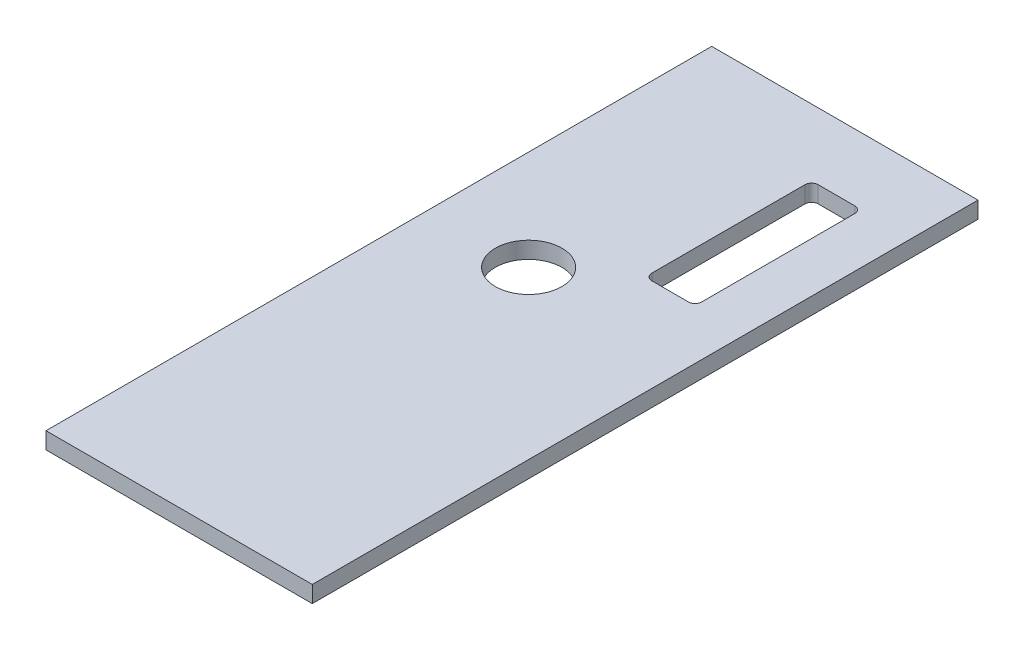
ISO-10303-21;
HEADER;
FILE_DESCRIPTION(('STEP AP214'),'2;1');
FILE_NAME('part.step','',(''),(''),'','','');
FILE_SCHEMA(('AUTOMOTIVE_DESIGN { 1 0 10303 214 1 1 1 1 }'));
ENDSEC;
DATA;
#1=APPLICATION_CONTEXT('core data for automotive mechanical design processes');
#2=APPLICATION_PROTOCOL_DEFINITION('international standard','automotive_design',2000,#1);
#3=PRODUCT_CONTEXT('',#1,'mechanical');
#4=PRODUCT('Part','Part','',(#3));
#5=PRODUCT_RELATED_PRODUCT_CATEGORY('part','',(#4));
#6=PRODUCT_DEFINITION_FORMATION('','',#4);
#7=PRODUCT_DEFINITION_CONTEXT('part definition',#1,'design');
#8=PRODUCT_DEFINITION('design','',#6,#7);
#9=PRODUCT_DEFINITION_SHAPE('','',#8);
#10=(LENGTH_UNIT() NAMED_UNIT(*) SI_UNIT(.MILLI.,.METRE.));
#11=(NAMED_UNIT(*) PLANE_ANGLE_UNIT() SI_UNIT($,.RADIAN.));
#12=(NAMED_UNIT(*) SI_UNIT($,.STERADIAN.) SOLID_ANGLE_UNIT());
#13=UNCERTAINTY_MEASURE_WITH_UNIT(LENGTH_MEASURE(1.E-05),#10,'distance_accuracy_value','');
#14=(GEOMETRIC_REPRESENTATION_CONTEXT(3) GLOBAL_UNCERTAINTY_ASSIGNED_CONTEXT((#13)) GLOBAL_UNIT_ASSIGNED_CONTEXT((#10,
#11,#12)) REPRESENTATION_CONTEXT('',''));
#15=CARTESIAN_POINT('',(0.,0.,0.));
#16=DIRECTION('',(0.,0.,1.));
#17=DIRECTION('',(1.,0.,0.));
#18=AXIS2_PLACEMENT_3D('',#15,#16,#17);
#19=CARTESIAN_POINT('',(0.,6.35,0.));
#20=DIRECTION('',(0.,1.,0.));
#21=DIRECTION('',(0.,0.,1.));
#22=AXIS2_PLACEMENT_3D('',#19,#20,#21);
#23=PLANE('',#22);
#24=DIRECTION('',(0.,0.,1.));
#25=VECTOR('',#24,1.);
#26=CARTESIAN_POINT('',(-50.8,6.35,127.));
#27=LINE('',#26,#25);
#28=CARTESIAN_POINT('',(-50.8,6.35,-127.));
#29=VERTEX_POINT('',#28);
#30=CARTESIAN_POINT('',(-50.8,6.35,127.));
#31=VERTEX_POINT('',#30);
#32=EDGE_CURVE('E193',#29,#31,#27,.T.);
#33=ORIENTED_EDGE('',*,*,#32,.T.);
#34=DIRECTION('',(1.,0.,0.));
#35=VECTOR('',#34,1.);
#36=CARTESIAN_POINT('',(50.8,6.35,127.));
#37=LINE('',#36,#35);
#38=CARTESIAN_POINT('',(50.8,6.35,127.));
#39=VERTEX_POINT('',#38);
#40=EDGE_CURVE('E196',#31,#39,#37,.T.);
#41=ORIENTED_EDGE('',*,*,#40,.T.);
#42=DIRECTION('',(0.,0.,-1.));
#43=VECTOR('',#42,1.);
#44=CARTESIAN_POINT('',(50.8,6.35,127.));
#45=LINE('',#44,#43);
#46=CARTESIAN_POINT('',(50.8,6.35,-127.));
#47=VERTEX_POINT('',#46);
#48=EDGE_CURVE('E199',#39,#47,#45,.T.);
#49=ORIENTED_EDGE('',*,*,#48,.T.);
#50=DIRECTION('',(-1.,0.,0.));
#51=VECTOR('',#50,1.);
#52=CARTESIAN_POINT('',(50.8,6.35,-127.));
#53=LINE('',#52,#51);
#54=EDGE_CURVE('E201',#47,#29,#53,.T.);
#55=ORIENTED_EDGE('',*,*,#54,.T.);
#56=EDGE_LOOP('',(#33,#41,#49,#55));
#57=FACE_BOUND('',#56,.T.);
#58=CARTESIAN_POINT('',(-12.7,6.35,-19.05));
#59=DIRECTION('',(0.,1.,0.));
#60=DIRECTION('',(0.,0.,1.));
#61=AXIS2_PLACEMENT_3D('',#58,#59,#60);
#62=CIRCLE('',#61,12.7);
#63=CARTESIAN_POINT('',(-12.7,6.35,-6.34999999999996));
#64=VERTEX_POINT('',#63);
#65=EDGE_CURVE('E187',#64,#64,#62,.T.);
#66=ORIENTED_EDGE('',*,*,#65,.F.);
#67=EDGE_LOOP('',(#66));
#68=FACE_BOUND('',#67,.T.);
#69=DIRECTION('',(1.,0.,0.));
#70=VECTOR('',#69,1.);
#71=CARTESIAN_POINT('',(29.21,6.35,-38.1));
#72=LINE('',#71,#70);
#73=CARTESIAN_POINT('',(15.24,6.35,-38.1));
#74=VERTEX_POINT('',#73);
#75=CARTESIAN_POINT('',(29.21,6.35,-38.1));
#76=VERTEX_POINT('',#75);
#77=EDGE_CURVE('E130',#74,#76,#72,.T.);
#78=ORIENTED_EDGE('',*,*,#77,.F.);
#79=CARTESIAN_POINT('',(15.24,6.35,-40.64));
#80=DIRECTION('',(0.,1.,0.));
#81=DIRECTION('',(0.,0.,-1.));
#82=AXIS2_PLACEMENT_3D('',#79,#80,#81);
#83=CIRCLE('',#82,2.54);
#84=CARTESIAN_POINT('',(12.7,6.35,-40.64));
#85=VERTEX_POINT('',#84);
#86=EDGE_CURVE('E122',#85,#74,#83,.T.);
#87=ORIENTED_EDGE('',*,*,#86,.F.);
#88=DIRECTION('',(0.,0.,1.));
#89=VECTOR('',#88,1.);
#90=CARTESIAN_POINT('',(12.7,6.35,-99.06));
#91=LINE('',#90,#89);
#92=CARTESIAN_POINT('',(12.7,6.35,-99.06));
#93=VERTEX_POINT('',#92);
#94=EDGE_CURVE('E155',#93,#85,#91,.T.);
#95=ORIENTED_EDGE('',*,*,#94,.F.);
#96=CARTESIAN_POINT('',(15.24,6.35,-99.06));
#97=DIRECTION('',(0.,1.,0.));
#98=DIRECTION('',(0.,0.,1.));
#99=AXIS2_PLACEMENT_3D('',#96,#97,#98);
#100=CIRCLE('',#99,2.54);
#101=CARTESIAN_POINT('',(15.24,6.35,-101.6));
#102=VERTEX_POINT('',#101);
#103=EDGE_CURVE('E153',#102,#93,#100,.T.);
#104=ORIENTED_EDGE('',*,*,#103,.F.);
#105=DIRECTION('',(-1.,0.,0.));
#106=VECTOR('',#105,1.);
#107=CARTESIAN_POINT('',(29.21,6.35,-101.6));
#108=LINE('',#107,#106);
#109=CARTESIAN_POINT('',(29.21,6.35,-101.6));
#110=VERTEX_POINT('',#109);
#111=EDGE_CURVE('E151',#110,#102,#108,.T.);
#112=ORIENTED_EDGE('',*,*,#111,.F.);
#113=CARTESIAN_POINT('',(29.21,6.35,-99.06));
#114=DIRECTION('',(0.,1.,0.));
#115=DIRECTION('',(0.,0.,-1.));
#116=AXIS2_PLACEMENT_3D('',#113,#114,#115);
#117=CIRCLE('',#116,2.54);
#118=CARTESIAN_POINT('',(31.75,6.35,-99.06));
#119=VERTEX_POINT('',#118);
#120=EDGE_CURVE('E149',#119,#110,#117,.T.);
#121=ORIENTED_EDGE('',*,*,#120,.F.);
#122=DIRECTION('',(0.,0.,-1.));
#123=VECTOR('',#122,1.);
#124=CARTESIAN_POINT('',(31.75,6.35,-99.06));
#125=LINE('',#124,#123);
#126=CARTESIAN_POINT('',(31.75,6.35,-40.64));
#127=VERTEX_POINT('',#126);
#128=EDGE_CURVE('E145',#127,#119,#125,.T.);
#129=ORIENTED_EDGE('',*,*,#128,.F.);
#130=CARTESIAN_POINT('',(29.21,6.35,-40.64));
#131=DIRECTION('',(0.,1.,0.));
#132=DIRECTION('',(0.,0.,-1.));
#133=AXIS2_PLACEMENT_3D('',#130,#131,#132);
#134=CIRCLE('',#133,2.54);
#135=EDGE_CURVE('E143',#76,#127,#134,.T.);
#136=ORIENTED_EDGE('',*,*,#135,.F.);
#137=EDGE_LOOP('',(#78,#87,#95,#104,#112,#121,#129,#136));
#138=FACE_BOUND('',#137,.T.);
#139=ADVANCED_FACE('F33',(#57,#68,#138),#23,.T.);
#140=CARTESIAN_POINT('',(0.,0.,0.));
#141=DIRECTION('',(0.,1.,0.));
#142=DIRECTION('',(0.,0.,1.));
#143=AXIS2_PLACEMENT_3D('',#140,#141,#142);
#144=PLANE('',#143);
#145=CARTESIAN_POINT('',(-12.7,0.,-19.05));
#146=DIRECTION('',(0.,1.,0.));
#147=DIRECTION('',(0.,0.,1.));
#148=AXIS2_PLACEMENT_3D('',#145,#146,#147);
#149=CIRCLE('',#148,12.7);
#150=CARTESIAN_POINT('',(-12.7,0.,-6.34999999999996));
#151=VERTEX_POINT('',#150);
#152=EDGE_CURVE('E138',#151,#151,#149,.T.);
#153=ORIENTED_EDGE('',*,*,#152,.T.);
#154=EDGE_LOOP('',(#153));
#155=FACE_BOUND('',#154,.T.);
#156=DIRECTION('',(0.,0.,1.));
#157=VECTOR('',#156,1.);
#158=CARTESIAN_POINT('',(-50.8,0.,127.));
#159=LINE('',#158,#157);
#160=CARTESIAN_POINT('',(-50.8,0.,-127.));
#161=VERTEX_POINT('',#160);
#162=CARTESIAN_POINT('',(-50.8,0.,127.));
#163=VERTEX_POINT('',#162);
#164=EDGE_CURVE('E190',#161,#163,#159,.T.);
#165=ORIENTED_EDGE('',*,*,#164,.F.);
#166=DIRECTION('',(-1.,0.,0.));
#167=VECTOR('',#166,1.);
#168=CARTESIAN_POINT('',(50.8,0.,-127.));
#169=LINE('',#168,#167);
#170=CARTESIAN_POINT('',(50.8,0.,-127.));
#171=VERTEX_POINT('',#170);
#172=EDGE_CURVE('E197',#171,#161,#169,.T.);
#173=ORIENTED_EDGE('',*,*,#172,.F.);
#174=DIRECTION('',(0.,0.,-1.));
#175=VECTOR('',#174,1.);
#176=CARTESIAN_POINT('',(50.8,0.,127.));
#177=LINE('',#176,#175);
#178=CARTESIAN_POINT('',(50.8,0.,127.));
#179=VERTEX_POINT('',#178);
#180=EDGE_CURVE('E208',#179,#171,#177,.T.);
#181=ORIENTED_EDGE('',*,*,#180,.F.);
#182=DIRECTION('',(1.,0.,0.));
#183=VECTOR('',#182,1.);
#184=CARTESIAN_POINT('',(50.8,0.,127.));
#185=LINE('',#184,#183);
#186=EDGE_CURVE('E206',#163,#179,#185,.T.);
#187=ORIENTED_EDGE('',*,*,#186,.F.);
#188=EDGE_LOOP('',(#165,#173,#181,#187));
#189=FACE_BOUND('',#188,.T.);
#190=CARTESIAN_POINT('',(15.24,0.,-40.64));
#191=DIRECTION('',(0.,1.,0.));
#192=DIRECTION('',(0.,0.,-1.));
#193=AXIS2_PLACEMENT_3D('',#190,#191,#192);
#194=CIRCLE('',#193,2.54);
#195=CARTESIAN_POINT('',(12.7,0.,-40.64));
#196=VERTEX_POINT('',#195);
#197=CARTESIAN_POINT('',(15.24,0.,-38.1));
#198=VERTEX_POINT('',#197);
#199=EDGE_CURVE('E56',#196,#198,#194,.T.);
#200=ORIENTED_EDGE('',*,*,#199,.T.);
#201=DIRECTION('',(1.,0.,0.));
#202=VECTOR('',#201,1.);
#203=CARTESIAN_POINT('',(29.21,0.,-38.1));
#204=LINE('',#203,#202);
#205=CARTESIAN_POINT('',(29.21,0.,-38.1));
#206=VERTEX_POINT('',#205);
#207=EDGE_CURVE('E137',#198,#206,#204,.T.);
#208=ORIENTED_EDGE('',*,*,#207,.T.);
#209=CARTESIAN_POINT('',(29.21,0.,-40.64));
#210=DIRECTION('',(0.,1.,0.));
#211=DIRECTION('',(0.,0.,-1.));
#212=AXIS2_PLACEMENT_3D('',#209,#210,#211);
#213=CIRCLE('',#212,2.54);
#214=CARTESIAN_POINT('',(31.75,0.,-40.64));
#215=VERTEX_POINT('',#214);
#216=EDGE_CURVE('E159',#206,#215,#213,.T.);
#217=ORIENTED_EDGE('',*,*,#216,.T.);
#218=DIRECTION('',(0.,0.,-1.));
#219=VECTOR('',#218,1.);
#220=CARTESIAN_POINT('',(31.75,0.,-99.06));
#221=LINE('',#220,#219);
#222=CARTESIAN_POINT('',(31.75,0.,-99.06));
#223=VERTEX_POINT('',#222);
#224=EDGE_CURVE('E162',#215,#223,#221,.T.);
#225=ORIENTED_EDGE('',*,*,#224,.T.);
#226=CARTESIAN_POINT('',(29.21,0.,-99.06));
#227=DIRECTION('',(0.,1.,0.));
#228=DIRECTION('',(0.,0.,-1.));
#229=AXIS2_PLACEMENT_3D('',#226,#227,#228);
#230=CIRCLE('',#229,2.54);
#231=CARTESIAN_POINT('',(29.21,0.,-101.6));
#232=VERTEX_POINT('',#231);
#233=EDGE_CURVE('E165',#223,#232,#230,.T.);
#234=ORIENTED_EDGE('',*,*,#233,.T.);
#235=DIRECTION('',(-1.,0.,0.));
#236=VECTOR('',#235,1.);
#237=CARTESIAN_POINT('',(29.21,0.,-101.6));
#238=LINE('',#237,#236);
#239=CARTESIAN_POINT('',(15.24,0.,-101.6));
#240=VERTEX_POINT('',#239);
#241=EDGE_CURVE('E168',#232,#240,#238,.T.);
#242=ORIENTED_EDGE('',*,*,#241,.T.);
#243=CARTESIAN_POINT('',(15.24,0.,-99.06));
#244=DIRECTION('',(0.,1.,0.));
#245=DIRECTION('',(0.,0.,1.));
#246=AXIS2_PLACEMENT_3D('',#243,#244,#245);
#247=CIRCLE('',#246,2.54);
#248=CARTESIAN_POINT('',(12.7,0.,-99.06));
#249=VERTEX_POINT('',#248);
#250=EDGE_CURVE('E171',#240,#249,#247,.T.);
#251=ORIENTED_EDGE('',*,*,#250,.T.);
#252=DIRECTION('',(0.,0.,1.));
#253=VECTOR('',#252,1.);
#254=CARTESIAN_POINT('',(12.7,0.,-99.06));
#255=LINE('',#254,#253);
#256=EDGE_CURVE('E131',#249,#196,#255,.T.);
#257=ORIENTED_EDGE('',*,*,#256,.T.);
#258=EDGE_LOOP('',(#200,#208,#217,#225,#234,#242,#251,#257));
#259=FACE_BOUND('',#258,.T.);
#260=ADVANCED_FACE('F226',(#155,#189,#259),#144,.F.);
#261=CARTESIAN_POINT('',(-50.8,6.35,127.));
#262=DIRECTION('',(1.,0.,0.));
#263=DIRECTION('',(0.,0.,-1.));
#264=AXIS2_PLACEMENT_3D('',#261,#262,#263);
#265=PLANE('',#264);
#266=ORIENTED_EDGE('',*,*,#164,.T.);
#267=DIRECTION('',(0.,-1.,0.));
#268=VECTOR('',#267,1.);
#269=CARTESIAN_POINT('',(-50.8,6.35,127.));
#270=LINE('',#269,#268);
#271=EDGE_CURVE('E11',#31,#163,#270,.T.);
#272=ORIENTED_EDGE('',*,*,#271,.F.);
#273=ORIENTED_EDGE('',*,*,#32,.F.);
#274=DIRECTION('',(0.,-1.,0.));
#275=VECTOR('',#274,1.);
#276=CARTESIAN_POINT('',(-50.8,6.35,-127.));
#277=LINE('',#276,#275);
#278=EDGE_CURVE('E203',#29,#161,#277,.T.);
#279=ORIENTED_EDGE('',*,*,#278,.T.);
#280=EDGE_LOOP('',(#266,#272,#273,#279));
#281=FACE_BOUND('',#280,.T.);
#282=ADVANCED_FACE('F35',(#281),#265,.F.);
#283=CARTESIAN_POINT('',(50.8,6.35,127.));
#284=DIRECTION('',(0.,0.,-1.));
#285=DIRECTION('',(-1.,0.,0.));
#286=AXIS2_PLACEMENT_3D('',#283,#284,#285);
#287=PLANE('',#286);
#288=ORIENTED_EDGE('',*,*,#186,.T.);
#289=DIRECTION('',(0.,-1.,0.));
#290=VECTOR('',#289,1.);
#291=CARTESIAN_POINT('',(50.8,6.35,127.));
#292=LINE('',#291,#290);
#293=EDGE_CURVE('E41',#39,#179,#292,.T.);
#294=ORIENTED_EDGE('',*,*,#293,.F.);
#295=ORIENTED_EDGE('',*,*,#40,.F.);
#296=ORIENTED_EDGE('',*,*,#271,.T.);
#297=EDGE_LOOP('',(#288,#294,#295,#296));
#298=FACE_BOUND('',#297,.T.);
#299=ADVANCED_FACE('F237',(#298),#287,.F.);
#300=CARTESIAN_POINT('',(50.8,6.35,127.));
#301=DIRECTION('',(-1.,0.,0.));
#302=DIRECTION('',(0.,0.,1.));
#303=AXIS2_PLACEMENT_3D('',#300,#301,#302);
#304=PLANE('',#303);
#305=ORIENTED_EDGE('',*,*,#180,.T.);
#306=DIRECTION('',(0.,-1.,0.));
#307=VECTOR('',#306,1.);
#308=CARTESIAN_POINT('',(50.8,6.35,-127.));
#309=LINE('',#308,#307);
#310=EDGE_CURVE('E213',#47,#171,#309,.T.);
#311=ORIENTED_EDGE('',*,*,#310,.F.);
#312=ORIENTED_EDGE('',*,*,#48,.F.);
#313=ORIENTED_EDGE('',*,*,#293,.T.);
#314=EDGE_LOOP('',(#305,#311,#312,#313));
#315=FACE_BOUND('',#314,.T.);
#316=ADVANCED_FACE('F220',(#315),#304,.F.);
#317=CARTESIAN_POINT('',(50.8,6.35,-127.));
#318=DIRECTION('',(0.,0.,1.));
#319=DIRECTION('',(1.,0.,0.));
#320=AXIS2_PLACEMENT_3D('',#317,#318,#319);
#321=PLANE('',#320);
#322=ORIENTED_EDGE('',*,*,#172,.T.);
#323=ORIENTED_EDGE('',*,*,#278,.F.);
#324=ORIENTED_EDGE('',*,*,#54,.F.);
#325=ORIENTED_EDGE('',*,*,#310,.T.);
#326=EDGE_LOOP('',(#322,#323,#324,#325));
#327=FACE_BOUND('',#326,.T.);
#328=ADVANCED_FACE('F230',(#327),#321,.F.);
#329=CARTESIAN_POINT('',(-12.7,6.35,-19.05));
#330=DIRECTION('',(0.,-1.,0.));
#331=DIRECTION('',(0.,0.,-1.));
#332=AXIS2_PLACEMENT_3D('',#329,#330,#331);
#333=CYLINDRICAL_SURFACE('',#332,12.7);
#334=ORIENTED_EDGE('',*,*,#65,.T.);
#335=EDGE_LOOP('',(#334));
#336=FACE_BOUND('',#335,.T.);
#337=ORIENTED_EDGE('',*,*,#152,.F.);
#338=EDGE_LOOP('',(#337));
#339=FACE_BOUND('',#338,.T.);
#340=ADVANCED_FACE('F252',(#336,#339),#333,.F.);
#341=CARTESIAN_POINT('',(15.24,6.35,-40.64));
#342=DIRECTION('',(0.,-1.,0.));
#343=DIRECTION('',(0.,0.,-1.));
#344=AXIS2_PLACEMENT_3D('',#341,#342,#343);
#345=CYLINDRICAL_SURFACE('',#344,2.54);
#346=ORIENTED_EDGE('',*,*,#199,.F.);
#347=DIRECTION('',(0.,-1.,0.));
#348=VECTOR('',#347,1.);
#349=CARTESIAN_POINT('',(12.7,6.35,-40.64));
#350=LINE('',#349,#348);
#351=EDGE_CURVE('E126',#85,#196,#350,.T.);
#352=ORIENTED_EDGE('',*,*,#351,.F.);
#353=ORIENTED_EDGE('',*,*,#86,.T.);
#354=DIRECTION('',(0.,-1.,0.));
#355=VECTOR('',#354,1.);
#356=CARTESIAN_POINT('',(15.24,6.35,-38.1));
#357=LINE('',#356,#355);
#358=EDGE_CURVE('E125',#74,#198,#357,.T.);
#359=ORIENTED_EDGE('',*,*,#358,.T.);
#360=EDGE_LOOP('',(#346,#352,#353,#359));
#361=FACE_BOUND('',#360,.T.);
#362=ADVANCED_FACE('F124',(#361),#345,.F.);
#363=CARTESIAN_POINT('',(29.21,6.35,-38.1));
#364=DIRECTION('',(0.,0.,-1.));
#365=DIRECTION('',(-1.,0.,0.));
#366=AXIS2_PLACEMENT_3D('',#363,#364,#365);
#367=PLANE('',#366);
#368=ORIENTED_EDGE('',*,*,#207,.F.);
#369=ORIENTED_EDGE('',*,*,#358,.F.);
#370=ORIENTED_EDGE('',*,*,#77,.T.);
#371=DIRECTION('',(0.,-1.,0.));
#372=VECTOR('',#371,1.);
#373=CARTESIAN_POINT('',(29.21,6.35,-38.1));
#374=LINE('',#373,#372);
#375=EDGE_CURVE('E139',#76,#206,#374,.T.);
#376=ORIENTED_EDGE('',*,*,#375,.T.);
#377=EDGE_LOOP('',(#368,#369,#370,#376));
#378=FACE_BOUND('',#377,.T.);
#379=ADVANCED_FACE('F134',(#378),#367,.T.);
#380=CARTESIAN_POINT('',(29.21,6.35,-40.64));
#381=DIRECTION('',(0.,-1.,0.));
#382=DIRECTION('',(0.,0.,-1.));
#383=AXIS2_PLACEMENT_3D('',#380,#381,#382);
#384=CYLINDRICAL_SURFACE('',#383,2.54);
#385=ORIENTED_EDGE('',*,*,#216,.F.);
#386=ORIENTED_EDGE('',*,*,#375,.F.);
#387=ORIENTED_EDGE('',*,*,#135,.T.);
#388=DIRECTION('',(0.,-1.,0.));
#389=VECTOR('',#388,1.);
#390=CARTESIAN_POINT('',(31.75,6.35,-40.64));
#391=LINE('',#390,#389);
#392=EDGE_CURVE('E184',#127,#215,#391,.T.);
#393=ORIENTED_EDGE('',*,*,#392,.T.);
#394=EDGE_LOOP('',(#385,#386,#387,#393));
#395=FACE_BOUND('',#394,.T.);
#396=ADVANCED_FACE('F269',(#395),#384,.F.);
#397=CARTESIAN_POINT('',(31.75,6.35,-99.06));
#398=DIRECTION('',(-1.,0.,0.));
#399=DIRECTION('',(0.,0.,1.));
#400=AXIS2_PLACEMENT_3D('',#397,#398,#399);
#401=PLANE('',#400);
#402=ORIENTED_EDGE('',*,*,#224,.F.);
#403=ORIENTED_EDGE('',*,*,#392,.F.);
#404=ORIENTED_EDGE('',*,*,#128,.T.);
#405=DIRECTION('',(0.,-1.,0.));
#406=VECTOR('',#405,1.);
#407=CARTESIAN_POINT('',(31.75,6.35,-99.06));
#408=LINE('',#407,#406);
#409=EDGE_CURVE('E182',#119,#223,#408,.T.);
#410=ORIENTED_EDGE('',*,*,#409,.T.);
#411=EDGE_LOOP('',(#402,#403,#404,#410));
#412=FACE_BOUND('',#411,.T.);
#413=ADVANCED_FACE('F274',(#412),#401,.T.);
#414=CARTESIAN_POINT('',(29.21,6.35,-99.06));
#415=DIRECTION('',(0.,-1.,0.));
#416=DIRECTION('',(0.,0.,-1.));
#417=AXIS2_PLACEMENT_3D('',#414,#415,#416);
#418=CYLINDRICAL_SURFACE('',#417,2.54);
#419=ORIENTED_EDGE('',*,*,#233,.F.);
#420=ORIENTED_EDGE('',*,*,#409,.F.);
#421=ORIENTED_EDGE('',*,*,#120,.T.);
#422=DIRECTION('',(0.,-1.,0.));
#423=VECTOR('',#422,1.);
#424=CARTESIAN_POINT('',(29.21,6.35,-101.6));
#425=LINE('',#424,#423);
#426=EDGE_CURVE('E180',#110,#232,#425,.T.);
#427=ORIENTED_EDGE('',*,*,#426,.T.);
#428=EDGE_LOOP('',(#419,#420,#421,#427));
#429=FACE_BOUND('',#428,.T.);
#430=ADVANCED_FACE('F278',(#429),#418,.F.);
#431=CARTESIAN_POINT('',(29.21,6.35,-101.6));
#432=DIRECTION('',(0.,0.,1.));
#433=DIRECTION('',(1.,0.,0.));
#434=AXIS2_PLACEMENT_3D('',#431,#432,#433);
#435=PLANE('',#434);
#436=ORIENTED_EDGE('',*,*,#241,.F.);
#437=ORIENTED_EDGE('',*,*,#426,.F.);
#438=ORIENTED_EDGE('',*,*,#111,.T.);
#439=DIRECTION('',(0.,-1.,0.));
#440=VECTOR('',#439,1.);
#441=CARTESIAN_POINT('',(15.24,6.35,-101.6));
#442=LINE('',#441,#440);
#443=EDGE_CURVE('E178',#102,#240,#442,.T.);
#444=ORIENTED_EDGE('',*,*,#443,.T.);
#445=EDGE_LOOP('',(#436,#437,#438,#444));
#446=FACE_BOUND('',#445,.T.);
#447=ADVANCED_FACE('F282',(#446),#435,.T.);
#448=CARTESIAN_POINT('',(15.24,6.35,-99.06));
#449=DIRECTION('',(0.,-1.,0.));
#450=DIRECTION('',(0.,0.,-1.));
#451=AXIS2_PLACEMENT_3D('',#448,#449,#450);
#452=CYLINDRICAL_SURFACE('',#451,2.54);
#453=ORIENTED_EDGE('',*,*,#250,.F.);
#454=ORIENTED_EDGE('',*,*,#443,.F.);
#455=ORIENTED_EDGE('',*,*,#103,.T.);
#456=DIRECTION('',(0.,-1.,0.));
#457=VECTOR('',#456,1.);
#458=CARTESIAN_POINT('',(12.7,6.35,-99.06));
#459=LINE('',#458,#457);
#460=EDGE_CURVE('E48',#93,#249,#459,.T.);
#461=ORIENTED_EDGE('',*,*,#460,.T.);
#462=EDGE_LOOP('',(#453,#454,#455,#461));
#463=FACE_BOUND('',#462,.T.);
#464=ADVANCED_FACE('F286',(#463),#452,.F.);
#465=CARTESIAN_POINT('',(12.7,6.35,-99.06));
#466=DIRECTION('',(1.,0.,0.));
#467=DIRECTION('',(0.,0.,-1.));
#468=AXIS2_PLACEMENT_3D('',#465,#466,#467);
#469=PLANE('',#468);
#470=ORIENTED_EDGE('',*,*,#256,.F.);
#471=ORIENTED_EDGE('',*,*,#460,.F.);
#472=ORIENTED_EDGE('',*,*,#94,.T.);
#473=ORIENTED_EDGE('',*,*,#351,.T.);
#474=EDGE_LOOP('',(#470,#471,#472,#473));
#475=FACE_BOUND('',#474,.T.);
#476=ADVANCED_FACE('F290',(#475),#469,.T.);
#477=CLOSED_SHELL('',(#139,#260,#282,#299,#316,#328,#340,#362,#379,#396,#413,#430,#447,#464,#476));
#478=MANIFOLD_SOLID_BREP('B2',#477);
#479=ADVANCED_BREP_SHAPE_REPRESENTATION('',(#18,#478),#14);
#480=SHAPE_DEFINITION_REPRESENTATION(#9,#479);
ENDSEC;
END-ISO-10303-21;
